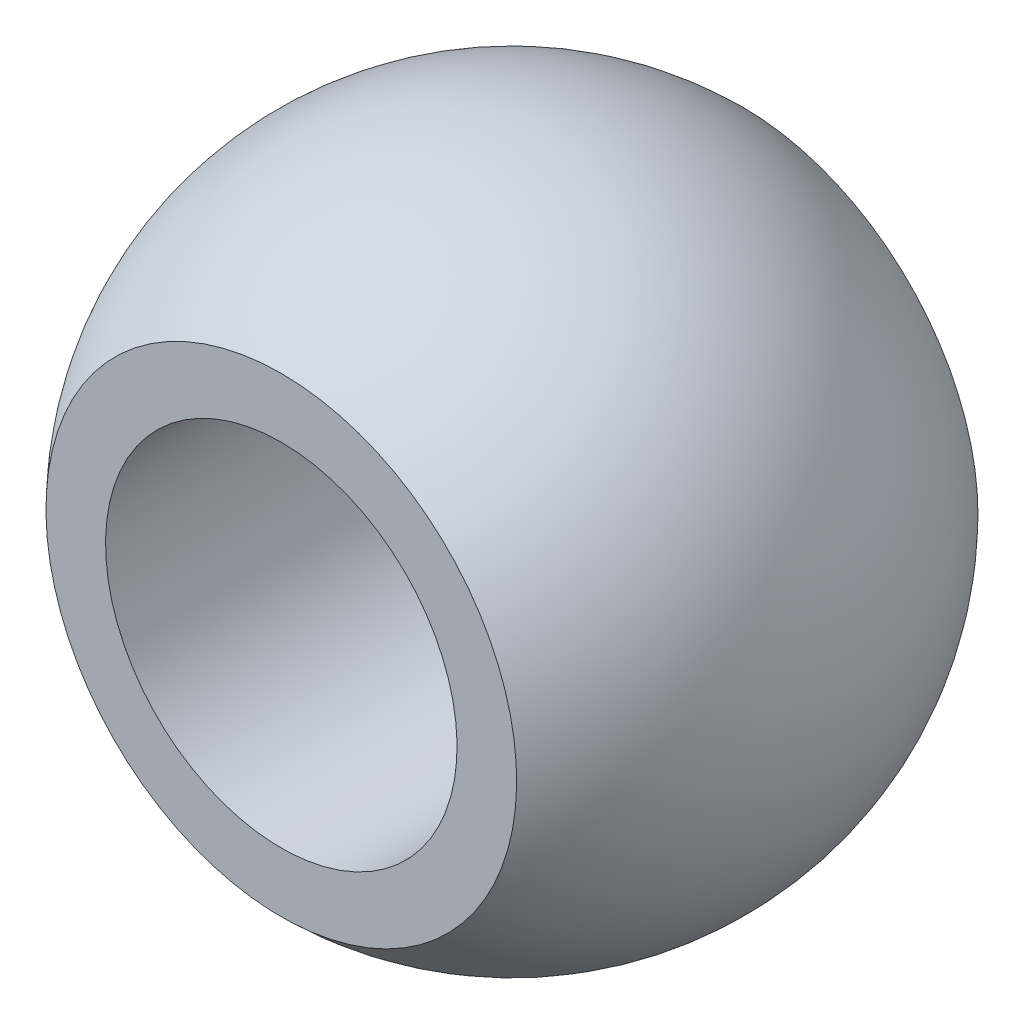
ISO-10303-21;
HEADER;
FILE_DESCRIPTION(('STEP AP214'),'2;1');
FILE_NAME('part.step','',(''),(''),'','','');
FILE_SCHEMA(('AUTOMOTIVE_DESIGN { 1 0 10303 214 1 1 1 1 }'));
ENDSEC;
DATA;
#1=APPLICATION_CONTEXT('core data for automotive mechanical design processes');
#2=APPLICATION_PROTOCOL_DEFINITION('international standard','automotive_design',2000,#1);
#3=PRODUCT_CONTEXT('',#1,'mechanical');
#4=PRODUCT('Part','Part','',(#3));
#5=PRODUCT_RELATED_PRODUCT_CATEGORY('part','',(#4));
#6=PRODUCT_DEFINITION_FORMATION('','',#4);
#7=PRODUCT_DEFINITION_CONTEXT('part definition',#1,'design');
#8=PRODUCT_DEFINITION('design','',#6,#7);
#9=PRODUCT_DEFINITION_SHAPE('','',#8);
#10=(LENGTH_UNIT() NAMED_UNIT(*) SI_UNIT(.MILLI.,.METRE.));
#11=(NAMED_UNIT(*) PLANE_ANGLE_UNIT() SI_UNIT($,.RADIAN.));
#12=(NAMED_UNIT(*) SI_UNIT($,.STERADIAN.) SOLID_ANGLE_UNIT());
#13=UNCERTAINTY_MEASURE_WITH_UNIT(LENGTH_MEASURE(1.E-05),#10,'distance_accuracy_value','');
#14=(GEOMETRIC_REPRESENTATION_CONTEXT(3) GLOBAL_UNCERTAINTY_ASSIGNED_CONTEXT((#13)) GLOBAL_UNIT_ASSIGNED_CONTEXT((#10,
#11,#12)) REPRESENTATION_CONTEXT('',''));
#15=CARTESIAN_POINT('',(0.,0.,0.));
#16=DIRECTION('',(0.,0.,1.));
#17=DIRECTION('',(1.,0.,0.));
#18=AXIS2_PLACEMENT_3D('',#15,#16,#17);
#19=CARTESIAN_POINT('',(0.,0.,-15.));
#20=DIRECTION('',(0.,0.,1.));
#21=DIRECTION('',(1.,0.,0.));
#22=AXIS2_PLACEMENT_3D('',#19,#20,#21);
#23=CYLINDRICAL_SURFACE('',#22,8.);
#24=CARTESIAN_POINT('',(0.,0.,10.5));
#25=DIRECTION('',(0.,0.,-1.));
#26=DIRECTION('',(0.,1.,0.));
#27=AXIS2_PLACEMENT_3D('',#24,#25,#26);
#28=CIRCLE('',#27,8.);
#29=CARTESIAN_POINT('',(0.,8.,10.5));
#30=VERTEX_POINT('',#29);
#31=EDGE_CURVE('E38',#30,#30,#28,.F.);
#32=ORIENTED_EDGE('',*,*,#31,.T.);
#33=EDGE_LOOP('',(#32));
#34=FACE_BOUND('',#33,.T.);
#35=CARTESIAN_POINT('',(0.,0.,-10.5));
#36=DIRECTION('',(0.,0.,1.));
#37=DIRECTION('',(0.,-1.,0.));
#38=AXIS2_PLACEMENT_3D('',#35,#36,#37);
#39=CIRCLE('',#38,8.);
#40=CARTESIAN_POINT('',(0.,-8.,-10.5));
#41=VERTEX_POINT('',#40);
#42=EDGE_CURVE('E48',#41,#41,#39,.F.);
#43=ORIENTED_EDGE('',*,*,#42,.T.);
#44=EDGE_LOOP('',(#43));
#45=FACE_BOUND('',#44,.T.);
#46=ADVANCED_FACE('F34',(#34,#45),#23,.F.);
#47=CARTESIAN_POINT('',(-15.,-10.7121426428143,-10.5));
#48=DIRECTION('',(0.,0.,1.));
#49=DIRECTION('',(0.,-1.,0.));
#50=AXIS2_PLACEMENT_3D('',#47,#48,#49);
#51=PLANE('',#50);
#52=CARTESIAN_POINT('',(0.,0.,-10.5));
#53=DIRECTION('',(0.,0.,1.));
#54=DIRECTION('',(0.,-1.,0.));
#55=AXIS2_PLACEMENT_3D('',#52,#53,#54);
#56=CIRCLE('',#55,10.7121426428143);
#57=CARTESIAN_POINT('',(0.,-10.7121426428143,-10.5));
#58=VERTEX_POINT('',#57);
#59=EDGE_CURVE('E46',#58,#58,#56,.F.);
#60=ORIENTED_EDGE('',*,*,#59,.T.);
#61=EDGE_LOOP('',(#60));
#62=FACE_BOUND('',#61,.T.);
#63=ORIENTED_EDGE('',*,*,#42,.F.);
#64=EDGE_LOOP('',(#63));
#65=FACE_BOUND('',#64,.T.);
#66=ADVANCED_FACE('F55',(#62,#65),#51,.F.);
#67=CARTESIAN_POINT('',(-15.,-10.7121426428143,10.5));
#68=DIRECTION('',(0.,0.,-1.));
#69=DIRECTION('',(0.,1.,0.));
#70=AXIS2_PLACEMENT_3D('',#67,#68,#69);
#71=PLANE('',#70);
#72=CARTESIAN_POINT('',(0.,0.,10.5));
#73=DIRECTION('',(0.,0.,-1.));
#74=DIRECTION('',(0.,1.,0.));
#75=AXIS2_PLACEMENT_3D('',#72,#73,#74);
#76=CIRCLE('',#75,10.7121426428143);
#77=CARTESIAN_POINT('',(0.,10.7121426428143,10.5));
#78=VERTEX_POINT('',#77);
#79=EDGE_CURVE('E10',#78,#78,#76,.F.);
#80=ORIENTED_EDGE('',*,*,#79,.T.);
#81=EDGE_LOOP('',(#80));
#82=FACE_BOUND('',#81,.T.);
#83=ORIENTED_EDGE('',*,*,#31,.F.);
#84=EDGE_LOOP('',(#83));
#85=FACE_BOUND('',#84,.T.);
#86=ADVANCED_FACE('F59',(#82,#85),#71,.F.);
#87=CARTESIAN_POINT('',(0.,0.,0.));
#88=DIRECTION('',(0.,1.,0.));
#89=DIRECTION('',(1.,0.,0.));
#90=AXIS2_PLACEMENT_3D('',#87,#88,#89);
#91=SPHERICAL_SURFACE('',#90,15.);
#92=CARTESIAN_POINT('',(0.,0.,0.));
#93=DIRECTION('',(0.,0.,-1.));
#94=DIRECTION('',(0.,1.,0.));
#95=AXIS2_PLACEMENT_3D('',#92,#93,#94);
#96=SPHERICAL_SURFACE('',#95,15.);
#97=ORIENTED_EDGE('',*,*,#79,.F.);
#98=EDGE_LOOP('',(#97));
#99=FACE_BOUND('',#98,.T.);
#100=ORIENTED_EDGE('',*,*,#59,.F.);
#101=EDGE_LOOP('',(#100));
#102=FACE_BOUND('',#101,.T.);
#103=ADVANCED_FACE('F36',(#99,#102),#96,.T.);
#104=CLOSED_SHELL('',(#46,#66,#86,#103));
#105=MANIFOLD_SOLID_BREP('B2',#104);
#106=ADVANCED_BREP_SHAPE_REPRESENTATION('',(#18,#105),#14);
#107=SHAPE_DEFINITION_REPRESENTATION(#9,#106);
ENDSEC;
END-ISO-10303-21;
